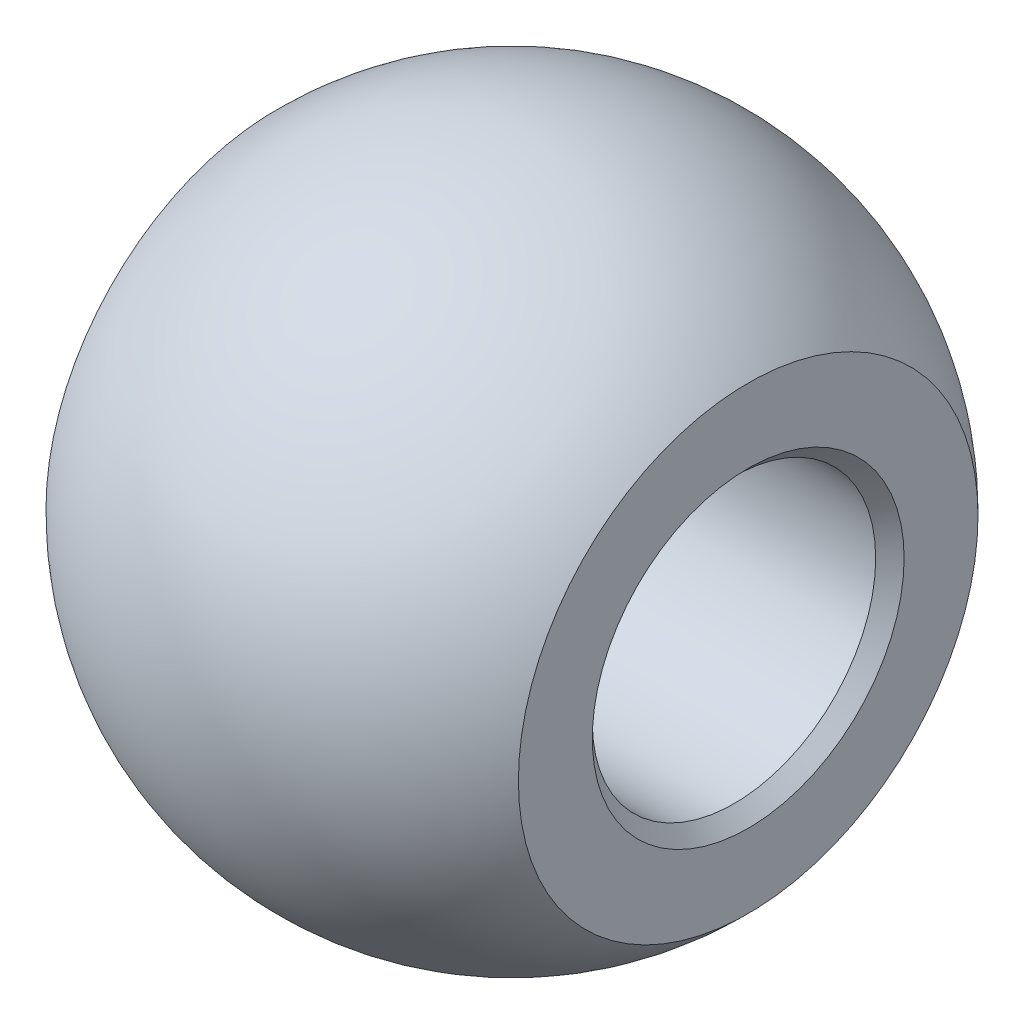
ISO-10303-21;
HEADER;
FILE_DESCRIPTION(('STEP AP214'),'2;1');
FILE_NAME('part.step','',(''),(''),'','','');
FILE_SCHEMA(('AUTOMOTIVE_DESIGN { 1 0 10303 214 1 1 1 1 }'));
ENDSEC;
DATA;
#1=APPLICATION_CONTEXT('core data for automotive mechanical design processes');
#2=APPLICATION_PROTOCOL_DEFINITION('international standard','automotive_design',2000,#1);
#3=PRODUCT_CONTEXT('',#1,'mechanical');
#4=PRODUCT('Part','Part','',(#3));
#5=PRODUCT_RELATED_PRODUCT_CATEGORY('part','',(#4));
#6=PRODUCT_DEFINITION_FORMATION('','',#4);
#7=PRODUCT_DEFINITION_CONTEXT('part definition',#1,'design');
#8=PRODUCT_DEFINITION('design','',#6,#7);
#9=PRODUCT_DEFINITION_SHAPE('','',#8);
#10=(LENGTH_UNIT() NAMED_UNIT(*) SI_UNIT(.MILLI.,.METRE.));
#11=(NAMED_UNIT(*) PLANE_ANGLE_UNIT() SI_UNIT($,.RADIAN.));
#12=(NAMED_UNIT(*) SI_UNIT($,.STERADIAN.) SOLID_ANGLE_UNIT());
#13=UNCERTAINTY_MEASURE_WITH_UNIT(LENGTH_MEASURE(1.E-05),#10,'distance_accuracy_value','');
#14=(GEOMETRIC_REPRESENTATION_CONTEXT(3) GLOBAL_UNCERTAINTY_ASSIGNED_CONTEXT((#13)) GLOBAL_UNIT_ASSIGNED_CONTEXT((#10,
#11,#12)) REPRESENTATION_CONTEXT('',''));
#15=CARTESIAN_POINT('',(0.,0.,0.));
#16=DIRECTION('',(0.,0.,1.));
#17=DIRECTION('',(1.,0.,0.));
#18=AXIS2_PLACEMENT_3D('',#15,#16,#17);
#19=CARTESIAN_POINT('',(0.,0.,0.));
#20=DIRECTION('',(0.,1.,0.));
#21=DIRECTION('',(1.,0.,0.));
#22=AXIS2_PLACEMENT_3D('',#19,#20,#21);
#23=SPHERICAL_SURFACE('',#22,5.5372);
#24=CARTESIAN_POINT('',(0.,0.,0.));
#25=DIRECTION('',(1.,0.,0.));
#26=DIRECTION('',(0.,0.,-1.));
#27=AXIS2_PLACEMENT_3D('',#24,#25,#26);
#28=SPHERICAL_SURFACE('',#27,5.5372);
#29=CARTESIAN_POINT('',(3.96875,0.,0.));
#30=DIRECTION('',(1.,0.,0.));
#31=DIRECTION('',(0.,0.,-1.));
#32=AXIS2_PLACEMENT_3D('',#29,#30,#31);
#33=CIRCLE('',#32,3.8612960618813);
#34=CARTESIAN_POINT('',(3.96875,0.,-3.8612960618813));
#35=VERTEX_POINT('',#34);
#36=EDGE_CURVE('E63',#35,#35,#33,.F.);
#37=ORIENTED_EDGE('',*,*,#36,.T.);
#38=EDGE_LOOP('',(#37));
#39=FACE_BOUND('',#38,.T.);
#40=CARTESIAN_POINT('',(-3.96875,0.,0.));
#41=DIRECTION('',(-1.,0.,0.));
#42=DIRECTION('',(0.,0.,1.));
#43=AXIS2_PLACEMENT_3D('',#40,#41,#42);
#44=CIRCLE('',#43,3.8612960618813);
#45=CARTESIAN_POINT('',(-3.96875,0.,3.8612960618813));
#46=VERTEX_POINT('',#45);
#47=EDGE_CURVE('E67',#46,#46,#44,.F.);
#48=ORIENTED_EDGE('',*,*,#47,.T.);
#49=EDGE_LOOP('',(#48));
#50=FACE_BOUND('',#49,.T.);
#51=ADVANCED_FACE('F38',(#39,#50),#28,.T.);
#52=CARTESIAN_POINT('',(-5.5372,0.,0.));
#53=DIRECTION('',(1.,0.,0.));
#54=DIRECTION('',(0.,0.,-1.));
#55=AXIS2_PLACEMENT_3D('',#52,#53,#54);
#56=CYLINDRICAL_SURFACE('',#55,2.38125);
#57=CARTESIAN_POINT('',(-3.72999,0.,0.));
#58=DIRECTION('',(-1.,0.,0.));
#59=DIRECTION('',(0.,0.,1.));
#60=AXIS2_PLACEMENT_3D('',#57,#58,#59);
#61=CIRCLE('',#60,2.38125);
#62=CARTESIAN_POINT('',(-3.72999,0.,2.38125));
#63=VERTEX_POINT('',#62);
#64=EDGE_CURVE('E47',#63,#63,#61,.T.);
#65=ORIENTED_EDGE('',*,*,#64,.T.);
#66=EDGE_LOOP('',(#65));
#67=FACE_BOUND('',#66,.T.);
#68=CARTESIAN_POINT('',(3.72999,0.,0.));
#69=DIRECTION('',(1.,0.,0.));
#70=DIRECTION('',(0.,0.,-1.));
#71=AXIS2_PLACEMENT_3D('',#68,#69,#70);
#72=CIRCLE('',#71,2.38125);
#73=CARTESIAN_POINT('',(3.72999,0.,-2.38125));
#74=VERTEX_POINT('',#73);
#75=EDGE_CURVE('E52',#74,#74,#72,.T.);
#76=ORIENTED_EDGE('',*,*,#75,.T.);
#77=EDGE_LOOP('',(#76));
#78=FACE_BOUND('',#77,.T.);
#79=ADVANCED_FACE('F85',(#67,#78),#56,.F.);
#80=CARTESIAN_POINT('',(3.96875,0.,0.));
#81=DIRECTION('',(1.,0.,0.));
#82=DIRECTION('',(0.,0.,-1.));
#83=AXIS2_PLACEMENT_3D('',#80,#81,#82);
#84=PLANE('',#83);
#85=CARTESIAN_POINT('',(3.96875,0.,0.));
#86=DIRECTION('',(1.,0.,0.));
#87=DIRECTION('',(0.,0.,-1.));
#88=AXIS2_PLACEMENT_3D('',#85,#86,#87);
#89=CIRCLE('',#88,2.62001);
#90=CARTESIAN_POINT('',(3.96875,0.,-2.62001));
#91=VERTEX_POINT('',#90);
#92=EDGE_CURVE('E10',#91,#91,#89,.F.);
#93=ORIENTED_EDGE('',*,*,#92,.T.);
#94=EDGE_LOOP('',(#93));
#95=FACE_BOUND('',#94,.T.);
#96=ORIENTED_EDGE('',*,*,#36,.F.);
#97=EDGE_LOOP('',(#96));
#98=FACE_BOUND('',#97,.T.);
#99=ADVANCED_FACE('F76',(#95,#98),#84,.T.);
#100=CARTESIAN_POINT('',(-3.96875,0.,0.));
#101=DIRECTION('',(-1.,0.,0.));
#102=DIRECTION('',(0.,0.,-1.));
#103=AXIS2_PLACEMENT_3D('',#100,#101,#102);
#104=PLANE('',#103);
#105=CARTESIAN_POINT('',(-3.96875,0.,0.));
#106=DIRECTION('',(-1.,0.,0.));
#107=DIRECTION('',(0.,0.,1.));
#108=AXIS2_PLACEMENT_3D('',#105,#106,#107);
#109=CIRCLE('',#108,2.62001);
#110=CARTESIAN_POINT('',(-3.96875,0.,2.62001));
#111=VERTEX_POINT('',#110);
#112=EDGE_CURVE('E57',#111,#111,#109,.F.);
#113=ORIENTED_EDGE('',*,*,#112,.T.);
#114=EDGE_LOOP('',(#113));
#115=FACE_BOUND('',#114,.T.);
#116=ORIENTED_EDGE('',*,*,#47,.F.);
#117=EDGE_LOOP('',(#116));
#118=FACE_BOUND('',#117,.T.);
#119=ADVANCED_FACE('F73',(#115,#118),#104,.T.);
#120=CARTESIAN_POINT('',(-3.96875,0.,0.));
#121=DIRECTION('',(-1.,0.,0.));
#122=DIRECTION('',(0.,0.,1.));
#123=AXIS2_PLACEMENT_3D('',#120,#121,#122);
#124=CONICAL_SURFACE('',#123,2.62001,0.78539816339745);
#125=ORIENTED_EDGE('',*,*,#64,.F.);
#126=EDGE_LOOP('',(#125));
#127=FACE_BOUND('',#126,.T.);
#128=ORIENTED_EDGE('',*,*,#112,.F.);
#129=EDGE_LOOP('',(#128));
#130=FACE_BOUND('',#129,.T.);
#131=ADVANCED_FACE('F75',(#127,#130),#124,.F.);
#132=CARTESIAN_POINT('',(3.96875,0.,0.));
#133=DIRECTION('',(1.,0.,0.));
#134=DIRECTION('',(0.,0.,-1.));
#135=AXIS2_PLACEMENT_3D('',#132,#133,#134);
#136=CONICAL_SURFACE('',#135,2.62001,0.785398163397447);
#137=ORIENTED_EDGE('',*,*,#75,.F.);
#138=EDGE_LOOP('',(#137));
#139=FACE_BOUND('',#138,.T.);
#140=ORIENTED_EDGE('',*,*,#92,.F.);
#141=EDGE_LOOP('',(#140));
#142=FACE_BOUND('',#141,.T.);
#143=ADVANCED_FACE('F41',(#139,#142),#136,.F.);
#144=CLOSED_SHELL('',(#51,#79,#99,#119,#131,#143));
#145=MANIFOLD_SOLID_BREP('B2',#144);
#146=ADVANCED_BREP_SHAPE_REPRESENTATION('',(#18,#145),#14);
#147=SHAPE_DEFINITION_REPRESENTATION(#9,#146);
ENDSEC;
END-ISO-10303-21;
